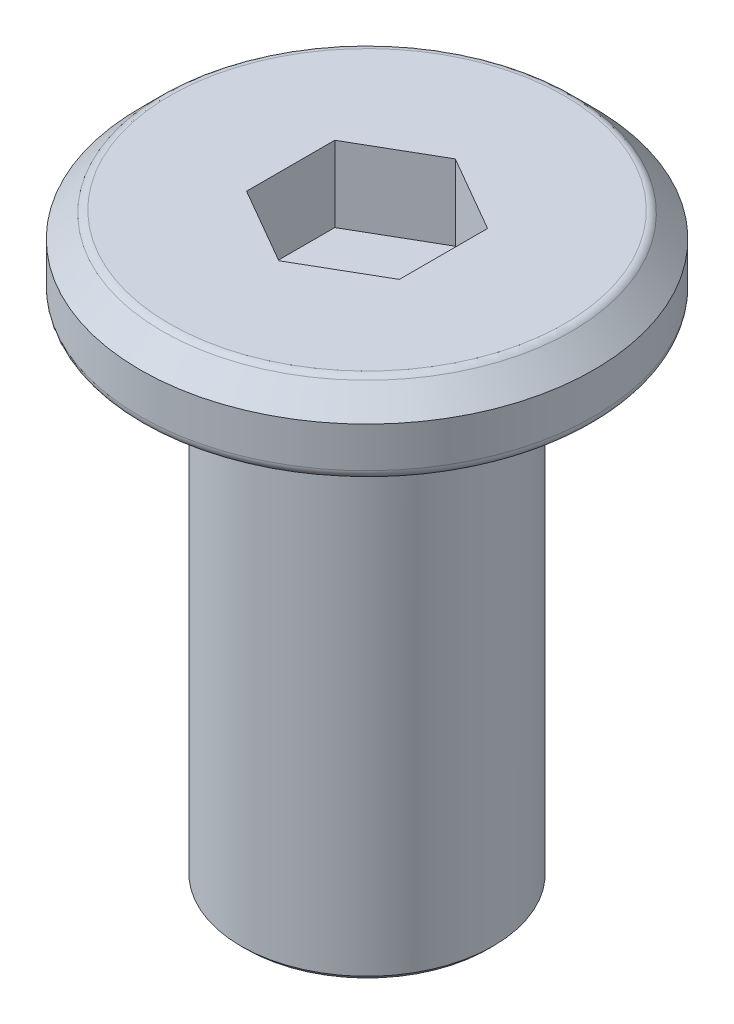
ISO-10303-21;
HEADER;
FILE_DESCRIPTION(('STEP AP214'),'2;1');
FILE_NAME('part.step','',(''),(''),'','','');
FILE_SCHEMA(('AUTOMOTIVE_DESIGN { 1 0 10303 214 1 1 1 1 }'));
ENDSEC;
DATA;
#1=APPLICATION_CONTEXT('core data for automotive mechanical design processes');
#2=APPLICATION_PROTOCOL_DEFINITION('international standard','automotive_design',2000,#1);
#3=PRODUCT_CONTEXT('',#1,'mechanical');
#4=PRODUCT('Part','Part','',(#3));
#5=PRODUCT_RELATED_PRODUCT_CATEGORY('part','',(#4));
#6=PRODUCT_DEFINITION_FORMATION('','',#4);
#7=PRODUCT_DEFINITION_CONTEXT('part definition',#1,'design');
#8=PRODUCT_DEFINITION('design','',#6,#7);
#9=PRODUCT_DEFINITION_SHAPE('','',#8);
#10=(LENGTH_UNIT() NAMED_UNIT(*) SI_UNIT(.MILLI.,.METRE.));
#11=(NAMED_UNIT(*) PLANE_ANGLE_UNIT() SI_UNIT($,.RADIAN.));
#12=(NAMED_UNIT(*) SI_UNIT($,.STERADIAN.) SOLID_ANGLE_UNIT());
#13=UNCERTAINTY_MEASURE_WITH_UNIT(LENGTH_MEASURE(1.E-05),#10,'distance_accuracy_value','');
#14=(GEOMETRIC_REPRESENTATION_CONTEXT(3) GLOBAL_UNCERTAINTY_ASSIGNED_CONTEXT((#13)) GLOBAL_UNIT_ASSIGNED_CONTEXT((#10,
#11,#12)) REPRESENTATION_CONTEXT('',''));
#15=CARTESIAN_POINT('',(0.,0.,0.));
#16=DIRECTION('',(0.,0.,1.));
#17=DIRECTION('',(1.,0.,0.));
#18=AXIS2_PLACEMENT_3D('',#15,#16,#17);
#19=CARTESIAN_POINT('',(0.,1.5,0.));
#20=DIRECTION('',(0.,-1.,0.));
#21=DIRECTION('',(0.,0.,-1.));
#22=AXIS2_PLACEMENT_3D('',#19,#20,#21);
#23=CYLINDRICAL_SURFACE('',#22,4.5);
#24=CARTESIAN_POINT('',(0.,0.2,0.));
#25=DIRECTION('',(0.,1.,0.));
#26=DIRECTION('',(0.,0.,1.));
#27=AXIS2_PLACEMENT_3D('',#24,#25,#26);
#28=CIRCLE('',#27,4.5);
#29=CARTESIAN_POINT('',(0.,0.2,4.5));
#30=VERTEX_POINT('',#29);
#31=EDGE_CURVE('E131',#30,#30,#28,.T.);
#32=ORIENTED_EDGE('',*,*,#31,.T.);
#33=EDGE_LOOP('',(#32));
#34=FACE_BOUND('',#33,.T.);
#35=CARTESIAN_POINT('',(0.,0.999999999999997,0.));
#36=DIRECTION('',(0.,1.,0.));
#37=DIRECTION('',(0.,0.,1.));
#38=AXIS2_PLACEMENT_3D('',#35,#36,#37);
#39=CIRCLE('',#38,4.5);
#40=CARTESIAN_POINT('',(0.,0.999999999999997,4.5));
#41=VERTEX_POINT('',#40);
#42=EDGE_CURVE('E117',#41,#41,#39,.F.);
#43=ORIENTED_EDGE('',*,*,#42,.T.);
#44=EDGE_LOOP('',(#43));
#45=FACE_BOUND('',#44,.T.);
#46=ADVANCED_FACE('F16',(#34,#45),#23,.T.);
#47=CARTESIAN_POINT('',(0.,1.5,0.));
#48=DIRECTION('',(0.,1.,0.));
#49=DIRECTION('',(0.,0.,1.));
#50=AXIS2_PLACEMENT_3D('',#47,#48,#49);
#51=PLANE('',#50);
#52=CARTESIAN_POINT('',(0.,1.5,0.));
#53=DIRECTION('',(0.,1.,0.));
#54=DIRECTION('',(0.,0.,1.));
#55=AXIS2_PLACEMENT_3D('',#52,#53,#54);
#56=CIRCLE('',#55,3.91715728752538);
#57=CARTESIAN_POINT('',(0.,1.5,3.91715728752538));
#58=VERTEX_POINT('',#57);
#59=EDGE_CURVE('E125',#58,#58,#56,.T.);
#60=ORIENTED_EDGE('',*,*,#59,.T.);
#61=EDGE_LOOP('',(#60));
#62=FACE_BOUND('',#61,.T.);
#63=DIRECTION('',(-0.866025403784438,0.,-0.5));
#64=VECTOR('',#63,1.);
#65=CARTESIAN_POINT('',(1.51554445662277,1.5,-0.875));
#66=LINE('',#65,#64);
#67=CARTESIAN_POINT('',(1.51554445662277,1.5,-0.875));
#68=VERTEX_POINT('',#67);
#69=CARTESIAN_POINT('',(0.,1.5,-1.75));
#70=VERTEX_POINT('',#69);
#71=EDGE_CURVE('E32',#68,#70,#66,.T.);
#72=ORIENTED_EDGE('',*,*,#71,.F.);
#73=DIRECTION('',(0.,0.,-1.));
#74=VECTOR('',#73,1.);
#75=CARTESIAN_POINT('',(1.51554445662277,1.5,0.875000000000001));
#76=LINE('',#75,#74);
#77=CARTESIAN_POINT('',(1.51554445662277,1.5,0.875000000000001));
#78=VERTEX_POINT('',#77);
#79=EDGE_CURVE('E113',#78,#68,#76,.T.);
#80=ORIENTED_EDGE('',*,*,#79,.F.);
#81=DIRECTION('',(0.866025403784439,0.,-0.5));
#82=VECTOR('',#81,1.);
#83=CARTESIAN_POINT('',(0.,1.5,1.75));
#84=LINE('',#83,#82);
#85=CARTESIAN_POINT('',(0.,1.5,1.75));
#86=VERTEX_POINT('',#85);
#87=EDGE_CURVE('E111',#86,#78,#84,.T.);
#88=ORIENTED_EDGE('',*,*,#87,.F.);
#89=DIRECTION('',(0.866025403784438,0.,0.5));
#90=VECTOR('',#89,1.);
#91=CARTESIAN_POINT('',(-1.51554445662277,1.5,0.874999999999999));
#92=LINE('',#91,#90);
#93=CARTESIAN_POINT('',(-1.51554445662277,1.5,0.874999999999999));
#94=VERTEX_POINT('',#93);
#95=EDGE_CURVE('E79',#94,#86,#92,.T.);
#96=ORIENTED_EDGE('',*,*,#95,.F.);
#97=DIRECTION('',(0.,0.,1.));
#98=VECTOR('',#97,1.);
#99=CARTESIAN_POINT('',(-1.51554445662277,1.5,-0.875));
#100=LINE('',#99,#98);
#101=CARTESIAN_POINT('',(-1.51554445662277,1.5,-0.875));
#102=VERTEX_POINT('',#101);
#103=EDGE_CURVE('E107',#102,#94,#100,.T.);
#104=ORIENTED_EDGE('',*,*,#103,.F.);
#105=DIRECTION('',(-0.866025403784439,0.,0.5));
#106=VECTOR('',#105,1.);
#107=CARTESIAN_POINT('',(0.,1.5,-1.75));
#108=LINE('',#107,#106);
#109=EDGE_CURVE('E104',#70,#102,#108,.T.);
#110=ORIENTED_EDGE('',*,*,#109,.F.);
#111=EDGE_LOOP('',(#72,#80,#88,#96,#104,#110));
#112=FACE_BOUND('',#111,.T.);
#113=ADVANCED_FACE('F158',(#62,#112),#51,.T.);
#114=CARTESIAN_POINT('',(0.,0.,0.));
#115=DIRECTION('',(0.,1.,0.));
#116=DIRECTION('',(0.,0.,1.));
#117=AXIS2_PLACEMENT_3D('',#114,#115,#116);
#118=PLANE('',#117);
#119=CARTESIAN_POINT('',(0.,0.,0.));
#120=DIRECTION('',(0.,1.,0.));
#121=DIRECTION('',(0.,0.,1.));
#122=AXIS2_PLACEMENT_3D('',#119,#120,#121);
#123=CIRCLE('',#122,2.75);
#124=CARTESIAN_POINT('',(0.,0.,2.75));
#125=VERTEX_POINT('',#124);
#126=EDGE_CURVE('E140',#125,#125,#123,.T.);
#127=ORIENTED_EDGE('',*,*,#126,.T.);
#128=EDGE_LOOP('',(#127));
#129=FACE_BOUND('',#128,.T.);
#130=CARTESIAN_POINT('',(0.,0.,0.));
#131=DIRECTION('',(0.,1.,0.));
#132=DIRECTION('',(0.,0.,1.));
#133=AXIS2_PLACEMENT_3D('',#130,#131,#132);
#134=CIRCLE('',#133,4.3);
#135=CARTESIAN_POINT('',(0.,0.,4.3));
#136=VERTEX_POINT('',#135);
#137=EDGE_CURVE('E134',#136,#136,#134,.F.);
#138=ORIENTED_EDGE('',*,*,#137,.T.);
#139=EDGE_LOOP('',(#138));
#140=FACE_BOUND('',#139,.T.);
#141=ADVANCED_FACE('F164',(#129,#140),#118,.F.);
#142=CARTESIAN_POINT('',(0.,1.5,0.));
#143=DIRECTION('',(0.,-1.,0.));
#144=DIRECTION('',(0.,0.,-1.));
#145=AXIS2_PLACEMENT_3D('',#142,#143,#144);
#146=CONICAL_SURFACE('',#145,4.,0.785398163397447);
#147=CARTESIAN_POINT('',(0.,1.44142135623731,0.));
#148=DIRECTION('',(0.,1.,0.));
#149=DIRECTION('',(0.,0.,1.));
#150=AXIS2_PLACEMENT_3D('',#147,#148,#149);
#151=CIRCLE('',#150,4.05857864376269);
#152=CARTESIAN_POINT('',(0.,1.44142135623731,4.05857864376269));
#153=VERTEX_POINT('',#152);
#154=EDGE_CURVE('E128',#153,#153,#151,.F.);
#155=ORIENTED_EDGE('',*,*,#154,.T.);
#156=EDGE_LOOP('',(#155));
#157=FACE_BOUND('',#156,.T.);
#158=ORIENTED_EDGE('',*,*,#42,.F.);
#159=EDGE_LOOP('',(#158));
#160=FACE_BOUND('',#159,.T.);
#161=ADVANCED_FACE('F170',(#157,#160),#146,.T.);
#162=CARTESIAN_POINT('',(1.51554445662277,0.,-0.875));
#163=DIRECTION('',(0.5,0.,-0.866025403784439));
#164=DIRECTION('',(-0.866025403784439,0.,-0.5));
#165=AXIS2_PLACEMENT_3D('',#162,#163,#164);
#166=PLANE('',#165);
#167=ORIENTED_EDGE('',*,*,#71,.T.);
#168=DIRECTION('',(0.,1.,0.));
#169=VECTOR('',#168,1.);
#170=CARTESIAN_POINT('',(0.,0.,-1.75));
#171=LINE('',#170,#169);
#172=CARTESIAN_POINT('',(0.,0.,-1.75));
#173=VERTEX_POINT('',#172);
#174=EDGE_CURVE('E63',#173,#70,#171,.T.);
#175=ORIENTED_EDGE('',*,*,#174,.F.);
#176=DIRECTION('',(-0.866025403784438,0.,-0.5));
#177=VECTOR('',#176,1.);
#178=CARTESIAN_POINT('',(1.51554445662277,0.,-0.875));
#179=LINE('',#178,#177);
#180=CARTESIAN_POINT('',(1.51554445662277,0.,-0.875));
#181=VERTEX_POINT('',#180);
#182=EDGE_CURVE('E115',#181,#173,#179,.T.);
#183=ORIENTED_EDGE('',*,*,#182,.F.);
#184=DIRECTION('',(0.,1.,0.));
#185=VECTOR('',#184,1.);
#186=CARTESIAN_POINT('',(1.51554445662277,0.,-0.875));
#187=LINE('',#186,#185);
#188=EDGE_CURVE('E40',#181,#68,#187,.T.);
#189=ORIENTED_EDGE('',*,*,#188,.T.);
#190=EDGE_LOOP('',(#167,#175,#183,#189));
#191=FACE_BOUND('',#190,.T.);
#192=ADVANCED_FACE('F173',(#191),#166,.F.);
#193=CARTESIAN_POINT('',(1.51554445662277,0.,0.875000000000001));
#194=DIRECTION('',(1.,0.,0.));
#195=DIRECTION('',(0.,0.,-1.));
#196=AXIS2_PLACEMENT_3D('',#193,#194,#195);
#197=PLANE('',#196);
#198=ORIENTED_EDGE('',*,*,#79,.T.);
#199=ORIENTED_EDGE('',*,*,#188,.F.);
#200=DIRECTION('',(0.,0.,-1.));
#201=VECTOR('',#200,1.);
#202=CARTESIAN_POINT('',(1.51554445662277,0.,0.875000000000001));
#203=LINE('',#202,#201);
#204=CARTESIAN_POINT('',(1.51554445662277,0.,0.875000000000001));
#205=VERTEX_POINT('',#204);
#206=EDGE_CURVE('E91',#205,#181,#203,.T.);
#207=ORIENTED_EDGE('',*,*,#206,.F.);
#208=DIRECTION('',(0.,1.,0.));
#209=VECTOR('',#208,1.);
#210=CARTESIAN_POINT('',(1.51554445662277,0.,0.875000000000001));
#211=LINE('',#210,#209);
#212=EDGE_CURVE('E83',#205,#78,#211,.T.);
#213=ORIENTED_EDGE('',*,*,#212,.T.);
#214=EDGE_LOOP('',(#198,#199,#207,#213));
#215=FACE_BOUND('',#214,.T.);
#216=ADVANCED_FACE('F207',(#215),#197,.F.);
#217=CARTESIAN_POINT('',(0.,0.,1.75));
#218=DIRECTION('',(0.5,0.,0.866025403784439));
#219=DIRECTION('',(0.866025403784439,0.,-0.5));
#220=AXIS2_PLACEMENT_3D('',#217,#218,#219);
#221=PLANE('',#220);
#222=ORIENTED_EDGE('',*,*,#87,.T.);
#223=ORIENTED_EDGE('',*,*,#212,.F.);
#224=DIRECTION('',(0.866025403784439,0.,-0.5));
#225=VECTOR('',#224,1.);
#226=CARTESIAN_POINT('',(0.,0.,1.75));
#227=LINE('',#226,#225);
#228=CARTESIAN_POINT('',(0.,0.,1.75));
#229=VERTEX_POINT('',#228);
#230=EDGE_CURVE('E87',#229,#205,#227,.T.);
#231=ORIENTED_EDGE('',*,*,#230,.F.);
#232=DIRECTION('',(0.,1.,0.));
#233=VECTOR('',#232,1.);
#234=CARTESIAN_POINT('',(0.,0.,1.75));
#235=LINE('',#234,#233);
#236=EDGE_CURVE('E72',#229,#86,#235,.T.);
#237=ORIENTED_EDGE('',*,*,#236,.T.);
#238=EDGE_LOOP('',(#222,#223,#231,#237));
#239=FACE_BOUND('',#238,.T.);
#240=ADVANCED_FACE('F88',(#239),#221,.F.);
#241=CARTESIAN_POINT('',(-1.51554445662277,0.,0.874999999999999));
#242=DIRECTION('',(-0.5,0.,0.866025403784438));
#243=DIRECTION('',(0.866025403784439,0.,0.5));
#244=AXIS2_PLACEMENT_3D('',#241,#242,#243);
#245=PLANE('',#244);
#246=ORIENTED_EDGE('',*,*,#95,.T.);
#247=ORIENTED_EDGE('',*,*,#236,.F.);
#248=DIRECTION('',(0.866025403784438,0.,0.5));
#249=VECTOR('',#248,1.);
#250=CARTESIAN_POINT('',(-1.51554445662277,0.,0.874999999999999));
#251=LINE('',#250,#249);
#252=CARTESIAN_POINT('',(-1.51554445662277,0.,0.874999999999999));
#253=VERTEX_POINT('',#252);
#254=EDGE_CURVE('E76',#253,#229,#251,.T.);
#255=ORIENTED_EDGE('',*,*,#254,.F.);
#256=DIRECTION('',(0.,1.,0.));
#257=VECTOR('',#256,1.);
#258=CARTESIAN_POINT('',(-1.51554445662277,0.,0.874999999999999));
#259=LINE('',#258,#257);
#260=EDGE_CURVE('E84',#253,#94,#259,.T.);
#261=ORIENTED_EDGE('',*,*,#260,.T.);
#262=EDGE_LOOP('',(#246,#247,#255,#261));
#263=FACE_BOUND('',#262,.T.);
#264=ADVANCED_FACE('F74',(#263),#245,.F.);
#265=CARTESIAN_POINT('',(-1.51554445662277,0.,-0.875));
#266=DIRECTION('',(-1.,0.,0.));
#267=DIRECTION('',(0.,0.,1.));
#268=AXIS2_PLACEMENT_3D('',#265,#266,#267);
#269=PLANE('',#268);
#270=ORIENTED_EDGE('',*,*,#103,.T.);
#271=ORIENTED_EDGE('',*,*,#260,.F.);
#272=DIRECTION('',(0.,0.,1.));
#273=VECTOR('',#272,1.);
#274=CARTESIAN_POINT('',(-1.51554445662277,0.,-0.875));
#275=LINE('',#274,#273);
#276=CARTESIAN_POINT('',(-1.51554445662277,0.,-0.875000000000001));
#277=VERTEX_POINT('',#276);
#278=EDGE_CURVE('E96',#277,#253,#275,.T.);
#279=ORIENTED_EDGE('',*,*,#278,.F.);
#280=DIRECTION('',(0.,1.,0.));
#281=VECTOR('',#280,1.);
#282=CARTESIAN_POINT('',(-1.51554445662277,0.,-0.875));
#283=LINE('',#282,#281);
#284=EDGE_CURVE('E120',#277,#102,#283,.T.);
#285=ORIENTED_EDGE('',*,*,#284,.T.);
#286=EDGE_LOOP('',(#270,#271,#279,#285));
#287=FACE_BOUND('',#286,.T.);
#288=ADVANCED_FACE('F214',(#287),#269,.F.);
#289=CARTESIAN_POINT('',(0.,0.,-1.75));
#290=DIRECTION('',(-0.5,0.,-0.866025403784439));
#291=DIRECTION('',(-0.866025403784439,0.,0.5));
#292=AXIS2_PLACEMENT_3D('',#289,#290,#291);
#293=PLANE('',#292);
#294=ORIENTED_EDGE('',*,*,#109,.T.);
#295=ORIENTED_EDGE('',*,*,#284,.F.);
#296=DIRECTION('',(-0.866025403784439,0.,0.5));
#297=VECTOR('',#296,1.);
#298=CARTESIAN_POINT('',(0.,0.,-1.75));
#299=LINE('',#298,#297);
#300=EDGE_CURVE('E98',#173,#277,#299,.T.);
#301=ORIENTED_EDGE('',*,*,#300,.F.);
#302=ORIENTED_EDGE('',*,*,#174,.T.);
#303=EDGE_LOOP('',(#294,#295,#301,#302));
#304=FACE_BOUND('',#303,.T.);
#305=ADVANCED_FACE('F204',(#304),#293,.F.);
#306=CARTESIAN_POINT('',(0.,0.,0.));
#307=DIRECTION('',(0.,-1.,0.));
#308=DIRECTION('',(0.,0.,-1.));
#309=AXIS2_PLACEMENT_3D('',#306,#307,#308);
#310=PLANE('',#309);
#311=ORIENTED_EDGE('',*,*,#206,.T.);
#312=ORIENTED_EDGE('',*,*,#182,.T.);
#313=ORIENTED_EDGE('',*,*,#300,.T.);
#314=ORIENTED_EDGE('',*,*,#278,.T.);
#315=ORIENTED_EDGE('',*,*,#254,.T.);
#316=ORIENTED_EDGE('',*,*,#230,.T.);
#317=EDGE_LOOP('',(#311,#312,#313,#314,#315,#316));
#318=FACE_BOUND('',#317,.T.);
#319=ADVANCED_FACE('F93',(#318),#310,.F.);
#320=CARTESIAN_POINT('',(0.,-10.,0.));
#321=DIRECTION('',(0.,1.,0.));
#322=DIRECTION('',(0.,0.,1.));
#323=AXIS2_PLACEMENT_3D('',#320,#321,#322);
#324=CYLINDRICAL_SURFACE('',#323,2.5);
#325=CARTESIAN_POINT('',(0.,-9.9,0.));
#326=DIRECTION('',(0.,-1.,0.));
#327=DIRECTION('',(0.,0.,-1.));
#328=AXIS2_PLACEMENT_3D('',#325,#326,#327);
#329=CIRCLE('',#328,2.5);
#330=CARTESIAN_POINT('',(0.,-9.9,-2.5));
#331=VERTEX_POINT('',#330);
#332=EDGE_CURVE('E10',#331,#331,#329,.F.);
#333=ORIENTED_EDGE('',*,*,#332,.T.);
#334=EDGE_LOOP('',(#333));
#335=FACE_BOUND('',#334,.T.);
#336=CARTESIAN_POINT('',(0.,-0.25,0.));
#337=DIRECTION('',(0.,1.,0.));
#338=DIRECTION('',(0.,0.,1.));
#339=AXIS2_PLACEMENT_3D('',#336,#337,#338);
#340=CIRCLE('',#339,2.5);
#341=CARTESIAN_POINT('',(0.,-0.25,2.5));
#342=VERTEX_POINT('',#341);
#343=EDGE_CURVE('E137',#342,#342,#340,.F.);
#344=ORIENTED_EDGE('',*,*,#343,.T.);
#345=EDGE_LOOP('',(#344));
#346=FACE_BOUND('',#345,.T.);
#347=ADVANCED_FACE('F195',(#335,#346),#324,.T.);
#348=CARTESIAN_POINT('',(0.,-10.,0.));
#349=DIRECTION('',(0.,-1.,0.));
#350=DIRECTION('',(0.,0.,-1.));
#351=AXIS2_PLACEMENT_3D('',#348,#349,#350);
#352=PLANE('',#351);
#353=CARTESIAN_POINT('',(0.,-10.,0.));
#354=DIRECTION('',(0.,-1.,0.));
#355=DIRECTION('',(0.,0.,-1.));
#356=AXIS2_PLACEMENT_3D('',#353,#354,#355);
#357=CIRCLE('',#356,2.4);
#358=CARTESIAN_POINT('',(0.,-10.,-2.4));
#359=VERTEX_POINT('',#358);
#360=EDGE_CURVE('E25',#359,#359,#357,.T.);
#361=ORIENTED_EDGE('',*,*,#360,.T.);
#362=EDGE_LOOP('',(#361));
#363=FACE_BOUND('',#362,.T.);
#364=ADVANCED_FACE('F145',(#363),#352,.T.);
#365=CARTESIAN_POINT('',(0.,1.3,0.));
#366=DIRECTION('',(0.,1.,0.));
#367=DIRECTION('',(0.,0.,1.));
#368=AXIS2_PLACEMENT_3D('',#365,#366,#367);
#369=TOROIDAL_SURFACE('',#368,3.91715728752538,0.2);
#370=ORIENTED_EDGE('',*,*,#154,.F.);
#371=EDGE_LOOP('',(#370));
#372=FACE_BOUND('',#371,.T.);
#373=ORIENTED_EDGE('',*,*,#59,.F.);
#374=EDGE_LOOP('',(#373));
#375=FACE_BOUND('',#374,.T.);
#376=ADVANCED_FACE('F175',(#372,#375),#369,.T.);
#377=CARTESIAN_POINT('',(0.,0.2,0.));
#378=DIRECTION('',(0.,1.,0.));
#379=DIRECTION('',(0.,0.,1.));
#380=AXIS2_PLACEMENT_3D('',#377,#378,#379);
#381=TOROIDAL_SURFACE('',#380,4.3,0.2);
#382=ORIENTED_EDGE('',*,*,#137,.F.);
#383=EDGE_LOOP('',(#382));
#384=FACE_BOUND('',#383,.T.);
#385=ORIENTED_EDGE('',*,*,#31,.F.);
#386=EDGE_LOOP('',(#385));
#387=FACE_BOUND('',#386,.T.);
#388=ADVANCED_FACE('F154',(#384,#387),#381,.T.);
#389=CARTESIAN_POINT('',(0.,-0.25,0.));
#390=DIRECTION('',(0.,1.,0.));
#391=DIRECTION('',(0.,0.,1.));
#392=AXIS2_PLACEMENT_3D('',#389,#390,#391);
#393=TOROIDAL_SURFACE('',#392,2.75,0.25);
#394=ORIENTED_EDGE('',*,*,#126,.F.);
#395=EDGE_LOOP('',(#394));
#396=FACE_BOUND('',#395,.T.);
#397=ORIENTED_EDGE('',*,*,#343,.F.);
#398=EDGE_LOOP('',(#397));
#399=FACE_BOUND('',#398,.T.);
#400=ADVANCED_FACE('F148',(#396,#399),#393,.F.);
#401=CARTESIAN_POINT('',(0.,-10.,0.));
#402=DIRECTION('',(0.,1.,0.));
#403=DIRECTION('',(0.,0.,1.));
#404=AXIS2_PLACEMENT_3D('',#401,#402,#403);
#405=CONICAL_SURFACE('',#404,2.4,0.785398163397446);
#406=ORIENTED_EDGE('',*,*,#332,.F.);
#407=EDGE_LOOP('',(#406));
#408=FACE_BOUND('',#407,.T.);
#409=ORIENTED_EDGE('',*,*,#360,.F.);
#410=EDGE_LOOP('',(#409));
#411=FACE_BOUND('',#410,.T.);
#412=ADVANCED_FACE('F19',(#408,#411),#405,.T.);
#413=CLOSED_SHELL('',(#46,#113,#141,#161,#192,#216,#240,#264,#288,#305,#319,#347,#364,#376,#388,
#400,#412));
#414=MANIFOLD_SOLID_BREP('B1',#413);
#415=ADVANCED_BREP_SHAPE_REPRESENTATION('',(#18,#414),#14);
#416=SHAPE_DEFINITION_REPRESENTATION(#9,#415);
ENDSEC;
END-ISO-10303-21;
